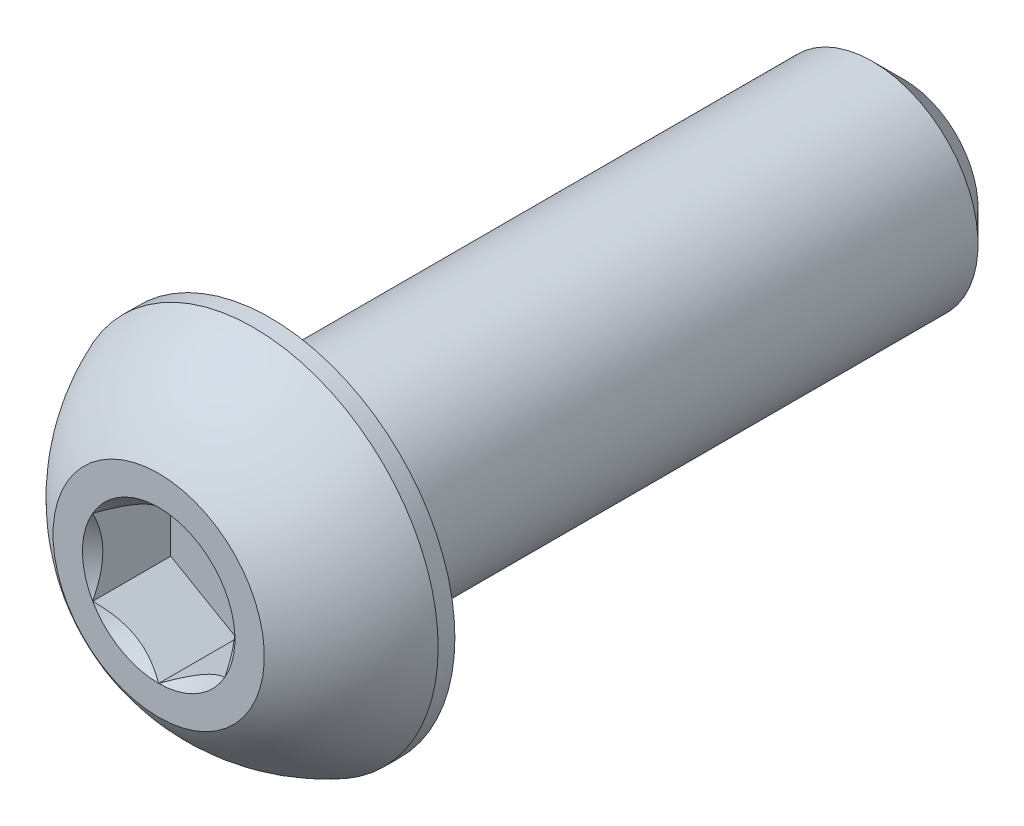
ISO-10303-21;
HEADER;
FILE_DESCRIPTION(('STEP AP214'),'2;1');
FILE_NAME('part.step','',(''),(''),'','','');
FILE_SCHEMA(('AUTOMOTIVE_DESIGN { 1 0 10303 214 1 1 1 1 }'));
ENDSEC;
DATA;
#1=APPLICATION_CONTEXT('core data for automotive mechanical design processes');
#2=APPLICATION_PROTOCOL_DEFINITION('international standard','automotive_design',2000,#1);
#3=PRODUCT_CONTEXT('',#1,'mechanical');
#4=PRODUCT('Part','Part','',(#3));
#5=PRODUCT_RELATED_PRODUCT_CATEGORY('part','',(#4));
#6=PRODUCT_DEFINITION_FORMATION('','',#4);
#7=PRODUCT_DEFINITION_CONTEXT('part definition',#1,'design');
#8=PRODUCT_DEFINITION('design','',#6,#7);
#9=PRODUCT_DEFINITION_SHAPE('','',#8);
#10=(LENGTH_UNIT() NAMED_UNIT(*) SI_UNIT(.MILLI.,.METRE.));
#11=(NAMED_UNIT(*) PLANE_ANGLE_UNIT() SI_UNIT($,.RADIAN.));
#12=(NAMED_UNIT(*) SI_UNIT($,.STERADIAN.) SOLID_ANGLE_UNIT());
#13=UNCERTAINTY_MEASURE_WITH_UNIT(LENGTH_MEASURE(1.E-05),#10,'distance_accuracy_value','');
#14=(GEOMETRIC_REPRESENTATION_CONTEXT(3) GLOBAL_UNCERTAINTY_ASSIGNED_CONTEXT((#13)) GLOBAL_UNIT_ASSIGNED_CONTEXT((#10,
#11,#12)) REPRESENTATION_CONTEXT('',''));
#15=CARTESIAN_POINT('',(0.,0.,0.));
#16=DIRECTION('',(0.,0.,1.));
#17=DIRECTION('',(1.,0.,0.));
#18=AXIS2_PLACEMENT_3D('',#15,#16,#17);
#19=CARTESIAN_POINT('',(0.,-3.175,-22.4028));
#20=DIRECTION('',(0.,0.,-1.));
#21=DIRECTION('',(0.,1.,0.));
#22=AXIS2_PLACEMENT_3D('',#19,#20,#21);
#23=PLANE('',#22);
#24=CARTESIAN_POINT('',(0.,0.,-22.4028));
#25=DIRECTION('',(0.,0.,-1.));
#26=DIRECTION('',(0.,1.,0.));
#27=AXIS2_PLACEMENT_3D('',#24,#25,#26);
#28=CIRCLE('',#27,2.22250000000001);
#29=CARTESIAN_POINT('',(0.,2.22250000000001,-22.4028));
#30=VERTEX_POINT('',#29);
#31=EDGE_CURVE('E181',#30,#30,#28,.T.);
#32=ORIENTED_EDGE('',*,*,#31,.T.);
#33=EDGE_LOOP('',(#32));
#34=FACE_BOUND('',#33,.T.);
#35=ADVANCED_FACE('F41',(#34),#23,.T.);
#36=CARTESIAN_POINT('',(0.,0.,-22.4028));
#37=DIRECTION('',(0.,0.,-1.));
#38=DIRECTION('',(0.,1.,0.));
#39=AXIS2_PLACEMENT_3D('',#36,#37,#38);
#40=CYLINDRICAL_SURFACE('',#39,3.175);
#41=CARTESIAN_POINT('',(0.,0.,-21.4503));
#42=DIRECTION('',(0.,0.,-1.));
#43=DIRECTION('',(0.,1.,0.));
#44=AXIS2_PLACEMENT_3D('',#41,#42,#43);
#45=CIRCLE('',#44,3.175);
#46=CARTESIAN_POINT('',(0.,3.175,-21.4503));
#47=VERTEX_POINT('',#46);
#48=EDGE_CURVE('E55',#47,#47,#45,.F.);
#49=ORIENTED_EDGE('',*,*,#48,.T.);
#50=EDGE_LOOP('',(#49));
#51=FACE_BOUND('',#50,.T.);
#52=CARTESIAN_POINT('',(0.,0.,-3.3528));
#53=DIRECTION('',(0.,0.,1.));
#54=DIRECTION('',(1.,0.,0.));
#55=AXIS2_PLACEMENT_3D('',#52,#53,#54);
#56=CIRCLE('',#55,3.175);
#57=CARTESIAN_POINT('',(3.175,0.,-3.3528));
#58=VERTEX_POINT('',#57);
#59=EDGE_CURVE('E178',#58,#58,#56,.F.);
#60=ORIENTED_EDGE('',*,*,#59,.T.);
#61=EDGE_LOOP('',(#60));
#62=FACE_BOUND('',#61,.T.);
#63=ADVANCED_FACE('F186',(#51,#62),#40,.T.);
#64=CARTESIAN_POINT('',(0.,0.,-22.4028));
#65=DIRECTION('',(0.,0.,1.));
#66=DIRECTION('',(0.,-1.,0.));
#67=AXIS2_PLACEMENT_3D('',#64,#65,#66);
#68=CONICAL_SURFACE('',#67,2.22250000000001,0.785398163397448);
#69=ORIENTED_EDGE('',*,*,#48,.F.);
#70=EDGE_LOOP('',(#69));
#71=FACE_BOUND('',#70,.T.);
#72=ORIENTED_EDGE('',*,*,#31,.F.);
#73=EDGE_LOOP('',(#72));
#74=FACE_BOUND('',#73,.T.);
#75=ADVANCED_FACE('F43',(#71,#74),#68,.T.);
#76=CARTESIAN_POINT('',(0.,0.,-5.060315));
#77=DIRECTION('',(0.,0.,1.));
#78=DIRECTION('',(0.,-1.,0.));
#79=AXIS2_PLACEMENT_3D('',#76,#77,#78);
#80=SPHERICAL_SURFACE('',#79,5.97389428256184);
#81=CARTESIAN_POINT('',(0.,0.,0.));
#82=DIRECTION('',(0.,0.,1.));
#83=DIRECTION('',(1.,0.,0.));
#84=AXIS2_PLACEMENT_3D('',#81,#82,#83);
#85=CIRCLE('',#84,3.175);
#86=CARTESIAN_POINT('',(0.,-3.175,0.));
#87=VERTEX_POINT('',#86);
#88=EDGE_CURVE('E175',#87,#87,#85,.T.);
#89=CARTESIAN_POINT('',(0.,0.,-2.84988));
#90=DIRECTION('',(0.,0.,1.));
#91=DIRECTION('',(1.,0.,0.));
#92=AXIS2_PLACEMENT_3D('',#89,#90,#91);
#93=CIRCLE('',#92,5.5499);
#94=CARTESIAN_POINT('',(0.,-5.5499,-2.84988));
#95=VERTEX_POINT('',#94);
#96=EDGE_CURVE('E169',#95,#95,#93,.T.);
#97=CARTESIAN_POINT('',(0.,-3.175,0.));
#98=CARTESIAN_POINT('',(0.,-3.20828343957184,-0.0208830076580502));
#99=CARTESIAN_POINT('',(0.,-3.24136078860705,-0.0420944789280503));
#100=CARTESIAN_POINT('',(0.,-3.30709055775141,-0.0851658910984718));
#101=CARTESIAN_POINT('',(0.,-3.33974297786056,-0.107025831998893));
#102=CARTESIAN_POINT('',(0.,-3.40461014130008,-0.151385725836676));
#103=CARTESIAN_POINT('',(0.,-3.43682488463043,-0.173885678774039));
#104=CARTESIAN_POINT('',(0.,-3.50080416139461,-0.219516822259479));
#105=CARTESIAN_POINT('',(0.,-3.53256869482844,-0.242648012807557));
#106=CARTESIAN_POINT('',(0.,-3.59563518208834,-0.289532629449102));
#107=CARTESIAN_POINT('',(0.,-3.62693713591442,-0.313286055542569));
#108=CARTESIAN_POINT('',(0.,-3.68906627753106,-0.36140589409133));
#109=CARTESIAN_POINT('',(0.,-3.71989346532163,-0.385772306546626));
#110=CARTESIAN_POINT('',(0.,-3.78106107243204,-0.435108631276877));
#111=CARTESIAN_POINT('',(0.,-3.8114014917519,-0.460078543551833));
#112=CARTESIAN_POINT('',(0.,-3.87158374923259,-0.510612146063938));
#113=CARTESIAN_POINT('',(0.,-3.90142558739343,-0.536175836301086));
#114=CARTESIAN_POINT('',(0.,-3.96059906392414,-0.587887041792083));
#115=CARTESIAN_POINT('',(0.,-3.989930702294,-0.614034557045931));
#116=CARTESIAN_POINT('',(0.,-4.04807235926832,-0.666903232293407));
#117=CARTESIAN_POINT('',(0.,-4.07688237787279,-0.693624392287034));
#118=CARTESIAN_POINT('',(0.,-4.13396957842491,-0.747629953401057));
#119=CARTESIAN_POINT('',(0.,-4.16224676037257,-0.774914354521453));
#120=CARTESIAN_POINT('',(0.,-4.21825727817542,-0.830035774981947));
#121=CARTESIAN_POINT('',(0.,-4.24599061403061,-0.857872794322045));
#122=CARTESIAN_POINT('',(0.,-4.30090264195357,-0.91408861315902));
#123=CARTESIAN_POINT('',(0.,-4.32808133402134,-0.942467412655899));
#124=CARTESIAN_POINT('',(0.,-4.38187349261953,-0.999755742806741));
#125=CARTESIAN_POINT('',(0.,-4.40848695914995,-1.0286652734607));
#126=CARTESIAN_POINT('',(0.,-4.46113830498838,-1.08700381029123));
#127=CARTESIAN_POINT('',(0.,-4.48717618429639,-1.11643281646778));
#128=CARTESIAN_POINT('',(0.,-4.53866621810402,-1.17579884645643));
#129=CARTESIAN_POINT('',(0.,-4.56411837260364,-1.20573587026853));
#130=CARTESIAN_POINT('',(0.,-4.61442704725457,-1.26610627984964));
#131=CARTESIAN_POINT('',(0.,-4.63928356740587,-1.29653966561866));
#132=CARTESIAN_POINT('',(0.,-4.68839129572448,-1.3578909501815));
#133=CARTESIAN_POINT('',(0.,-4.71264250389178,-1.38880884897531));
#134=CARTESIAN_POINT('',(0.,-4.76053016627881,-1.45111712201534));
#135=CARTESIAN_POINT('',(0.,-4.78416662049853,-1.48250749626155));
#136=CARTESIAN_POINT('',(0.,-4.8308155723751,-1.54574849868041));
#137=CARTESIAN_POINT('',(0.,-4.85382807003194,-1.57759912685306));
#138=CARTESIAN_POINT('',(0.,-4.89922014909859,-1.64174823640362));
#139=CARTESIAN_POINT('',(0.,-4.92159973050841,-1.67404671778154));
#140=CARTESIAN_POINT('',(0.,-4.96571726381658,-1.73907895865427));
#141=CARTESIAN_POINT('',(0.,-4.98745521571493,-1.77181271814908));
#142=CARTESIAN_POINT('',(0.,-5.03028102654719,-1.83770277069632));
#143=CARTESIAN_POINT('',(0.,-5.0513688854811,-1.87085906374874));
#144=CARTESIAN_POINT('',(0.,-5.09288630004063,-1.93758127434189));
#145=CARTESIAN_POINT('',(0.,-5.11331585566624,-1.97114719188261));
#146=CARTESIAN_POINT('',(0.,-5.15350870956168,-2.03867558290299));
#147=CARTESIAN_POINT('',(0.,-5.17327200783151,-2.07263805638265));
#148=CARTESIAN_POINT('',(0.,-5.21212465239608,-2.14094633632486));
#149=CARTESIAN_POINT('',(0.,-5.23121399869082,-2.17529214278741));
#150=CARTESIAN_POINT('',(0.,-5.26871130697935,-2.2443537165359));
#151=CARTESIAN_POINT('',(0.,-5.28711926897315,-2.27906948382184));
#152=CARTESIAN_POINT('',(0.,-5.32324664200827,-2.3488574628552));
#153=CARTESIAN_POINT('',(0.,-5.3409660530496,-2.38392967460262));
#154=CARTESIAN_POINT('',(0.,-5.37570942417474,-2.45441688802313));
#155=CARTESIAN_POINT('',(0.,-5.39273338425856,-2.48983188969622));
#156=CARTESIAN_POINT('',(0.,-5.42607922958184,-2.56099089271574));
#157=CARTESIAN_POINT('',(0.,-5.44240111482132,-2.59673489406217));
#158=CARTESIAN_POINT('',(0.,-5.47433643994316,-2.66853798649801));
#159=CARTESIAN_POINT('',(0.,-5.48994987982553,-2.70459707758742));
#160=CARTESIAN_POINT('',(0.,-5.52046229408188,-2.77701628549785));
#161=CARTESIAN_POINT('',(0.,-5.53536126845586,-2.81337640231887));
#162=CARTESIAN_POINT('',(0.,-5.5499,-2.84988));
#163=B_SPLINE_CURVE_WITH_KNOTS('',3,(#97,#98,#99,#100,#101,#102,#103,#104,#105,#106,#107,#108,
#109,#110,#111,#112,#113,#114,#115,#116,#117,#118,#119,#120,#121,#122,#123,#124,#125,#126,#127,
#128,#129,#130,#131,#132,#133,#134,#135,#136,#137,#138,#139,#140,#141,#142,#143,#144,#145,#146,
#147,#148,#149,#150,#151,#152,#153,#154,#155,#156,#157,#158,#159,#160,#161,#162),.UNSPECIFIED.,
.F.,.F.,(4,2,2,2,2,2,2,2,2,2,2,2,2,2,2,2,2,2,2,2,2,2,2,2,2,2,2,2,2,2,2,2,4),(0.,0.1178750807537,
0.235750161507399,0.353625242261099,0.471500323014798,0.589375403768498,0.707250484522198,
0.825125565275897,0.943000646029597,1.0608757267833,1.17875080753699,1.2966258882907,
1.41450096904439,1.53237604979809,1.65025113055179,1.76812621130549,1.88600129205919,
2.00387637281289,2.12175145356659,2.23962653432029,2.35750161507399,2.47537669582769,
2.59325177658139,2.71112685733509,2.82900193808879,2.94687701884249,3.06475209959619,
3.18262718034989,3.30050226110359,3.41837734185729,3.53625242261099,3.65412750336469,
3.77200258411839),.UNSPECIFIED.);
#164=EDGE_CURVE('BSEAM191',#87,#95,#163,.T.);
#165=ORIENTED_EDGE('',*,*,#88,.F.);
#166=ORIENTED_EDGE('',*,*,#96,.T.);
#167=ORIENTED_EDGE('',*,*,#164,.T.);
#168=ORIENTED_EDGE('',*,*,#164,.F.);
#169=EDGE_LOOP('',(#165,#167,#166,#168));
#170=FACE_BOUND('',#169,.T.);
#171=ADVANCED_FACE('F191',(#170),#80,.T.);
#172=CARTESIAN_POINT('',(0.,-3.175,0.));
#173=DIRECTION('',(0.,0.,-1.));
#174=DIRECTION('',(-1.,0.,0.));
#175=AXIS2_PLACEMENT_3D('',#172,#173,#174);
#176=PLANE('',#175);
#177=CARTESIAN_POINT('',(0.,0.,0.));
#178=DIRECTION('',(0.,0.,1.));
#179=DIRECTION('',(1.,0.,0.));
#180=AXIS2_PLACEMENT_3D('',#177,#178,#179);
#181=CIRCLE('',#180,2.29135888084633);
#182=CARTESIAN_POINT('',(-1.984375,1.14567944042316,0.));
#183=VERTEX_POINT('',#182);
#184=CARTESIAN_POINT('',(-1.984375,-1.14567944042316,0.));
#185=VERTEX_POINT('',#184);
#186=EDGE_CURVE('E68',#183,#185,#181,.T.);
#187=ORIENTED_EDGE('',*,*,#186,.F.);
#188=CARTESIAN_POINT('',(0.,2.29135888084633,0.));
#189=VERTEX_POINT('',#188);
#190=EDGE_CURVE('E140',#189,#183,#181,.T.);
#191=ORIENTED_EDGE('',*,*,#190,.F.);
#192=CARTESIAN_POINT('',(1.984375,1.14567944042316,0.));
#193=VERTEX_POINT('',#192);
#194=EDGE_CURVE('E137',#193,#189,#181,.T.);
#195=ORIENTED_EDGE('',*,*,#194,.F.);
#196=CARTESIAN_POINT('',(1.984375,-1.14567944042316,0.));
#197=VERTEX_POINT('',#196);
#198=EDGE_CURVE('E108',#197,#193,#181,.T.);
#199=ORIENTED_EDGE('',*,*,#198,.F.);
#200=CARTESIAN_POINT('',(0.,-2.29135888084633,0.));
#201=VERTEX_POINT('',#200);
#202=EDGE_CURVE('E100',#201,#197,#181,.T.);
#203=ORIENTED_EDGE('',*,*,#202,.F.);
#204=EDGE_CURVE('E61',#185,#201,#181,.T.);
#205=ORIENTED_EDGE('',*,*,#204,.F.);
#206=EDGE_LOOP('',(#187,#191,#195,#199,#203,#205));
#207=FACE_BOUND('',#206,.T.);
#208=ORIENTED_EDGE('',*,*,#88,.T.);
#209=EDGE_LOOP('',(#208));
#210=FACE_BOUND('',#209,.T.);
#211=ADVANCED_FACE('F134',(#207,#210),#176,.F.);
#212=CARTESIAN_POINT('',(0.,-5.5499,-3.3528));
#213=DIRECTION('',(0.,0.,1.));
#214=DIRECTION('',(1.,0.,0.));
#215=AXIS2_PLACEMENT_3D('',#212,#213,#214);
#216=PLANE('',#215);
#217=ORIENTED_EDGE('',*,*,#59,.F.);
#218=EDGE_LOOP('',(#217));
#219=FACE_BOUND('',#218,.T.);
#220=CARTESIAN_POINT('',(0.,0.,-3.3528));
#221=DIRECTION('',(0.,0.,1.));
#222=DIRECTION('',(1.,0.,0.));
#223=AXIS2_PLACEMENT_3D('',#220,#221,#222);
#224=CIRCLE('',#223,5.5499);
#225=CARTESIAN_POINT('',(5.5499,0.,-3.3528));
#226=VERTEX_POINT('',#225);
#227=EDGE_CURVE('E172',#226,#226,#224,.T.);
#228=ORIENTED_EDGE('',*,*,#227,.F.);
#229=EDGE_LOOP('',(#228));
#230=FACE_BOUND('',#229,.T.);
#231=ADVANCED_FACE('F205',(#219,#230),#216,.F.);
#232=CARTESIAN_POINT('',(0.,0.,0.));
#233=DIRECTION('',(0.,0.,1.));
#234=DIRECTION('',(1.,0.,0.));
#235=AXIS2_PLACEMENT_3D('',#232,#233,#234);
#236=CYLINDRICAL_SURFACE('',#235,5.5499);
#237=ORIENTED_EDGE('',*,*,#96,.F.);
#238=EDGE_LOOP('',(#237));
#239=FACE_BOUND('',#238,.T.);
#240=ORIENTED_EDGE('',*,*,#227,.T.);
#241=EDGE_LOOP('',(#240));
#242=FACE_BOUND('',#241,.T.);
#243=ADVANCED_FACE('F208',(#239,#242),#236,.T.);
#244=CARTESIAN_POINT('',(0.,0.,0.));
#245=DIRECTION('',(0.,0.,1.));
#246=DIRECTION('',(1.,0.,0.));
#247=AXIS2_PLACEMENT_3D('',#244,#245,#246);
#248=CONICAL_SURFACE('',#247,2.29135888084633,0.78539816339745);
#249=ORIENTED_EDGE('',*,*,#198,.T.);
#250=CARTESIAN_POINT('',(1.984375,-2.28495242157822,0.734984078816568));
#251=CARTESIAN_POINT('',(1.984375,-2.22931635455402,0.692986685550762));
#252=CARTESIAN_POINT('',(1.984375,-2.17336876548389,0.651396054076336));
#253=CARTESIAN_POINT('',(1.984375,-2.06072770258171,0.569208461471479));
#254=CARTESIAN_POINT('',(1.984375,-2.00403404503435,0.528611752405042));
#255=CARTESIAN_POINT('',(1.984375,-1.88936329173488,0.448303503174668));
#256=CARTESIAN_POINT('',(1.984375,-1.83137965519348,0.408601258813307));
#257=CARTESIAN_POINT('',(1.984375,-1.7144280213784,0.330685173401292));
#258=CARTESIAN_POINT('',(1.984375,-1.65546009407228,0.292471227194368));
#259=CARTESIAN_POINT('',(1.984375,-1.47005472306035,0.176252834013637));
#260=CARTESIAN_POINT('',(1.984375,-1.34163909427883,0.101347886872381));
#261=CARTESIAN_POINT('',(1.984375,-1.0784038470548,-0.0356697845602627));
#262=CARTESIAN_POINT('',(1.984375,-0.943607781407424,-0.0978256335176254));
#263=CARTESIAN_POINT('',(1.984375,-0.741275100444881,-0.173867421311381));
#264=CARTESIAN_POINT('',(1.984375,-0.676735408881095,-0.195691938673995));
#265=CARTESIAN_POINT('',(1.984375,-0.546098118112761,-0.234159536462205));
#266=CARTESIAN_POINT('',(1.984375,-0.480000411919955,-0.250802259934452));
#267=CARTESIAN_POINT('',(1.984375,-0.347746170028531,-0.277764619130277));
#268=CARTESIAN_POINT('',(1.984375,-0.281612071479122,-0.288192590264109));
#269=CARTESIAN_POINT('',(1.984375,-0.14863662005235,-0.302521852623404));
#270=CARTESIAN_POINT('',(1.984375,-0.0817953907393235,-0.306424265772614));
#271=CARTESIAN_POINT('',(1.984375,0.0495156750890644,-0.307412948667327));
#272=CARTESIAN_POINT('',(1.984375,0.113983775102991,-0.304740821124985));
#273=CARTESIAN_POINT('',(1.984375,0.242367515846177,-0.293260789502485));
#274=CARTESIAN_POINT('',(1.984375,0.30628310229592,-0.284452289360786));
#275=CARTESIAN_POINT('',(1.984375,0.434181040262184,-0.261030978667103));
#276=CARTESIAN_POINT('',(1.984375,0.498145026858309,-0.246319393767914));
#277=CARTESIAN_POINT('',(1.984375,0.624675616953007,-0.211873818587874));
#278=CARTESIAN_POINT('',(1.984375,0.687242336899689,-0.192140248550805));
#279=CARTESIAN_POINT('',(1.984375,0.884225483826088,-0.12258776276924));
#280=CARTESIAN_POINT('',(1.984375,1.01583674256468,-0.0648475887435034));
#281=CARTESIAN_POINT('',(1.984375,1.27288659242652,0.063530336588798));
#282=CARTESIAN_POINT('',(1.984375,1.3983008827048,0.134214424919413));
#283=CARTESIAN_POINT('',(1.984375,1.57956687990221,0.244516663813199));
#284=CARTESIAN_POINT('',(1.984375,1.63738271299424,0.280969829475364));
#285=CARTESIAN_POINT('',(1.984375,1.75202215386202,0.355415963291705));
#286=CARTESIAN_POINT('',(1.984375,1.80884568601362,0.393409048078054));
#287=CARTESIAN_POINT('',(1.984375,1.92116923084255,0.470338808893091));
#288=CARTESIAN_POINT('',(1.984375,1.97667624512253,0.509265313038791));
#289=CARTESIAN_POINT('',(1.984375,2.08693170717166,0.588147746121386));
#290=CARTESIAN_POINT('',(1.984375,2.14168035934793,0.62810338902403));
#291=CARTESIAN_POINT('',(1.984375,2.19611149046622,0.668480611285427));
#292=B_SPLINE_CURVE_WITH_KNOTS('',3,(#250,#251,#252,#253,#254,#255,#256,#257,#258,#259,#260,
#261,#262,#263,#264,#265,#266,#267,#268,#269,#270,#271,#272,#273,#274,#275,#276,#277,#278,#279,
#280,#281,#282,#283,#284,#285,#286,#287,#288,#289,#290,#291),.UNSPECIFIED.,.F.,.F.,(4,2,2,2,2,2,
2,2,2,2,2,2,2,2,2,2,2,2,2,2,4),(0.,0.209126070008322,0.418304637356569,0.629103979977992,
0.839888401371185,1.28549951116127,1.72957750768351,1.93379389749971,2.13802435186698,
2.33858179514334,2.53910475350639,2.73236963400794,2.92565329006887,3.12231577097487,
3.31896180041345,3.74886295245172,4.18033428125362,4.3853601718029,4.59040161996383,
4.79377749165108,4.99709743524131),.UNSPECIFIED.);
#293=EDGE_CURVE('E11',#197,#193,#292,.T.);
#294=ORIENTED_EDGE('',*,*,#293,.F.);
#295=EDGE_LOOP('',(#249,#294));
#296=FACE_BOUND('',#295,.T.);
#297=ADVANCED_FACE('F112',(#296),#248,.F.);
#298=ORIENTED_EDGE('',*,*,#194,.T.);
#299=CARTESIAN_POINT('',(1.984575,1.14556397036933,0.000115478781843379));
#300=CARTESIAN_POINT('',(1.9163590048332,1.18494849354192,-0.0392371477360855));
#301=CARTESIAN_POINT('',(1.84700231489303,1.22499159714897,-0.0762786895538155));
#302=CARTESIAN_POINT('',(1.70557619954781,1.30664400291398,-0.144101141576677));
#303=CARTESIAN_POINT('',(1.63349332126322,1.34826107209555,-0.174844310908246));
#304=CARTESIAN_POINT('',(1.488141602734,1.43217992591557,-0.227508111188786));
#305=CARTESIAN_POINT('',(1.41490978751306,1.47446033414663,-0.249561124120036));
#306=CARTESIAN_POINT('',(1.26683381740529,1.55995203534886,-0.283538507056124));
#307=CARTESIAN_POINT('',(1.19199418724658,1.60316071596705,-0.295488243908271));
#308=CARTESIAN_POINT('',(1.06301458545618,1.6776271237807,-0.306269900918094));
#309=CARTESIAN_POINT('',(1.00904128422756,1.7087886237741,-0.30786610094093));
#310=CARTESIAN_POINT('',(0.901182881480199,1.77106070163465,-0.305178161134708));
#311=CARTESIAN_POINT('',(0.847297817514476,1.80217125782056,-0.300891959659541));
#312=CARTESIAN_POINT('',(0.740036461751395,1.86409863044402,-0.286683126986481));
#313=CARTESIAN_POINT('',(0.686660807239859,1.89491507894443,-0.276754189547727));
#314=CARTESIAN_POINT('',(0.580832482591103,1.95601509066828,-0.251804915725461));
#315=CARTESIAN_POINT('',(0.528379742028898,1.9862986945516,-0.236784969610512));
#316=CARTESIAN_POINT('',(0.394017661036351,2.06387267818152,-0.19219214836433));
#317=CARTESIAN_POINT('',(0.312941642841675,2.11068193911104,-0.159257004061667));
#318=CARTESIAN_POINT('',(0.19372669327016,2.17951072233758,-0.103657558797803));
#319=CARTESIAN_POINT('',(0.154440075613998,2.20219286161692,-0.0841224079481375));
#320=CARTESIAN_POINT('',(0.0765946381319467,2.24713694590237,-0.0432712618805984));
#321=CARTESIAN_POINT('',(0.0380353888983008,2.26939913882716,-0.0219563604316496));
#322=CARTESIAN_POINT('',(-0.00020000000000058,2.29147435090017,0.000115478781842942));
#323=B_SPLINE_CURVE_WITH_KNOTS('',3,(#299,#300,#301,#302,#303,#304,#305,#306,#307,#308,#309,
#310,#311,#312,#313,#314,#315,#316,#317,#318,#319,#320,#321,#322),.UNSPECIFIED.,.F.,.F.,(4,2,2,
2,2,2,2,2,2,2,2,4),(0.,0.264339630306627,0.530219665093694,0.79187641637146,1.05287424418109,
1.239639843932,1.42647091743852,1.61351120244035,1.8005371524754,2.09764209964316,
2.24579179873714,2.39385111134157),.UNSPECIFIED.);
#324=EDGE_CURVE('E139',#193,#189,#323,.T.);
#325=ORIENTED_EDGE('',*,*,#324,.F.);
#326=EDGE_LOOP('',(#298,#325));
#327=FACE_BOUND('',#326,.T.);
#328=ADVANCED_FACE('F293',(#327),#248,.F.);
#329=ORIENTED_EDGE('',*,*,#190,.T.);
#330=CARTESIAN_POINT('',(0.000199999999999608,2.29147435090017,0.000115478781843248));
#331=CARTESIAN_POINT('',(-0.0680159951668025,2.25208982772757,-0.0392371477360854));
#332=CARTESIAN_POINT('',(-0.137372685106966,2.21204672412052,-0.0762786895538155));
#333=CARTESIAN_POINT('',(-0.278798800452188,2.13039431835551,-0.144101141576677));
#334=CARTESIAN_POINT('',(-0.350881678736783,2.08877724917394,-0.174844310908246));
#335=CARTESIAN_POINT('',(-0.496233397266004,2.00485839535392,-0.227508111188786));
#336=CARTESIAN_POINT('',(-0.569465212486939,1.96257798712287,-0.249561124120036));
#337=CARTESIAN_POINT('',(-0.717541182594707,1.87708628592063,-0.283538507056124));
#338=CARTESIAN_POINT('',(-0.792380812753425,1.83387760530244,-0.295488243908272));
#339=CARTESIAN_POINT('',(-0.921360414543816,1.75941119748879,-0.306269900918094));
#340=CARTESIAN_POINT('',(-0.975333715772443,1.72824969749539,-0.307866100940931));
#341=CARTESIAN_POINT('',(-1.0831921185198,1.66597761963484,-0.305178161134708));
#342=CARTESIAN_POINT('',(-1.13707718248552,1.63486706344893,-0.300891959659541));
#343=CARTESIAN_POINT('',(-1.2443385382486,1.57293969082547,-0.286683126986481));
#344=CARTESIAN_POINT('',(-1.29771419276014,1.54212324232506,-0.276754189547727));
#345=CARTESIAN_POINT('',(-1.4035425174089,1.48102323060122,-0.251804915725462));
#346=CARTESIAN_POINT('',(-1.4559952579711,1.45073962671789,-0.236784969610512));
#347=CARTESIAN_POINT('',(-1.59035733896365,1.37316564308797,-0.19219214836433));
#348=CARTESIAN_POINT('',(-1.67143335715832,1.32635638215845,-0.159257004061668));
#349=CARTESIAN_POINT('',(-1.79064830672984,1.25752759893191,-0.103657558797804));
#350=CARTESIAN_POINT('',(-1.829934924386,1.23484545965257,-0.0841224079481378));
#351=CARTESIAN_POINT('',(-1.90778036186805,1.18990137536712,-0.0432712618805986));
#352=CARTESIAN_POINT('',(-1.9463396111017,1.16763918244233,-0.0219563604316498));
#353=CARTESIAN_POINT('',(-1.984575,1.14556397036933,0.000115478781842511));
#354=B_SPLINE_CURVE_WITH_KNOTS('',3,(#330,#331,#332,#333,#334,#335,#336,#337,#338,#339,#340,
#341,#342,#343,#344,#345,#346,#347,#348,#349,#350,#351,#352,#353),.UNSPECIFIED.,.F.,.F.,(4,2,2,
2,2,2,2,2,2,2,2,4),(0.,0.264339630306627,0.530219665093694,0.791876416371461,1.05287424418109,
1.239639843932,1.42647091743852,1.61351120244035,1.8005371524754,2.09764209964316,
2.24579179873714,2.39385111134157),.UNSPECIFIED.);
#355=EDGE_CURVE('E144',#189,#183,#354,.T.);
#356=ORIENTED_EDGE('',*,*,#355,.F.);
#357=EDGE_LOOP('',(#329,#356));
#358=FACE_BOUND('',#357,.T.);
#359=ADVANCED_FACE('F147',(#358),#248,.F.);
#360=ORIENTED_EDGE('',*,*,#186,.T.);
#361=CARTESIAN_POINT('',(-1.984375,-2.28495242157823,0.734984078816569));
#362=CARTESIAN_POINT('',(-1.984375,-2.22931635455402,0.692986685550762));
#363=CARTESIAN_POINT('',(-1.984375,-2.17336876548389,0.651396054076336));
#364=CARTESIAN_POINT('',(-1.984375,-2.06072770258171,0.56920846147148));
#365=CARTESIAN_POINT('',(-1.984375,-2.00403404503435,0.528611752405043));
#366=CARTESIAN_POINT('',(-1.984375,-1.88936329173489,0.448303503174669));
#367=CARTESIAN_POINT('',(-1.984375,-1.83137965519348,0.408601258813308));
#368=CARTESIAN_POINT('',(-1.984375,-1.7144280213784,0.330685173401292));
#369=CARTESIAN_POINT('',(-1.984375,-1.65546009407228,0.292471227194368));
#370=CARTESIAN_POINT('',(-1.984375,-1.47005472306035,0.176252834013636));
#371=CARTESIAN_POINT('',(-1.984375,-1.34163909427883,0.101347886872382));
#372=CARTESIAN_POINT('',(-1.984375,-1.0784038470548,-0.0356697845602624));
#373=CARTESIAN_POINT('',(-1.984375,-0.943607781407425,-0.0978256335176256));
#374=CARTESIAN_POINT('',(-1.984375,-0.741275100444882,-0.173867421311381));
#375=CARTESIAN_POINT('',(-1.984375,-0.676735408881095,-0.195691938673995));
#376=CARTESIAN_POINT('',(-1.984375,-0.546098118112762,-0.234159536462205));
#377=CARTESIAN_POINT('',(-1.984375,-0.480000411919956,-0.250802259934452));
#378=CARTESIAN_POINT('',(-1.984375,-0.347746170028532,-0.277764619130277));
#379=CARTESIAN_POINT('',(-1.984375,-0.281612071479123,-0.288192590264108));
#380=CARTESIAN_POINT('',(-1.984375,-0.14863662005235,-0.302521852623404));
#381=CARTESIAN_POINT('',(-1.984375,-0.0817953907393237,-0.306424265772614));
#382=CARTESIAN_POINT('',(-1.984375,0.0495156750890643,-0.307412948667328));
#383=CARTESIAN_POINT('',(-1.984375,0.113983775102991,-0.304740821124985));
#384=CARTESIAN_POINT('',(-1.984375,0.242367515846177,-0.293260789502485));
#385=CARTESIAN_POINT('',(-1.984375,0.306283102295919,-0.284452289360786));
#386=CARTESIAN_POINT('',(-1.984375,0.434181040262184,-0.261030978667103));
#387=CARTESIAN_POINT('',(-1.984375,0.498145026858309,-0.246319393767914));
#388=CARTESIAN_POINT('',(-1.984375,0.624675616953007,-0.211873818587874));
#389=CARTESIAN_POINT('',(-1.984375,0.687242336899689,-0.192140248550805));
#390=CARTESIAN_POINT('',(-1.984375,0.884225483826087,-0.12258776276924));
#391=CARTESIAN_POINT('',(-1.984375,1.01583674256468,-0.0648475887435036));
#392=CARTESIAN_POINT('',(-1.984375,1.27288659242652,0.0635303365887976));
#393=CARTESIAN_POINT('',(-1.984375,1.3983008827048,0.134214424919412));
#394=CARTESIAN_POINT('',(-1.984375,1.57956687990221,0.244516663813198));
#395=CARTESIAN_POINT('',(-1.984375,1.63738271299424,0.280969829475363));
#396=CARTESIAN_POINT('',(-1.984375,1.75202215386202,0.355415963291704));
#397=CARTESIAN_POINT('',(-1.984375,1.80884568601362,0.393409048078054));
#398=CARTESIAN_POINT('',(-1.984375,1.92116923084255,0.47033880889309));
#399=CARTESIAN_POINT('',(-1.984375,1.97667624512253,0.509265313038791));
#400=CARTESIAN_POINT('',(-1.984375,2.08693170717166,0.588147746121386));
#401=CARTESIAN_POINT('',(-1.984375,2.14168035934793,0.628103389024029));
#402=CARTESIAN_POINT('',(-1.984375,2.19611149046622,0.668480611285426));
#403=B_SPLINE_CURVE_WITH_KNOTS('',3,(#361,#362,#363,#364,#365,#366,#367,#368,#369,#370,#371,
#372,#373,#374,#375,#376,#377,#378,#379,#380,#381,#382,#383,#384,#385,#386,#387,#388,#389,#390,
#391,#392,#393,#394,#395,#396,#397,#398,#399,#400,#401,#402),.UNSPECIFIED.,.F.,.F.,(4,2,2,2,2,2,
2,2,2,2,2,2,2,2,2,2,2,2,2,2,4),(0.,0.209126070008322,0.41830463735657,0.629103979977993,
0.839888401371186,1.28549951116127,1.72957750768351,1.93379389749972,2.13802435186698,
2.33858179514334,2.53910475350639,2.73236963400794,2.92565329006887,3.12231577097488,
3.31896180041345,3.74886295245172,4.18033428125362,4.3853601718029,4.59040161996383,
4.79377749165108,4.99709743524131),.UNSPECIFIED.);
#404=EDGE_CURVE('E151',#183,#185,#403,.F.);
#405=ORIENTED_EDGE('',*,*,#404,.F.);
#406=EDGE_LOOP('',(#360,#405));
#407=FACE_BOUND('',#406,.T.);
#408=ADVANCED_FACE('F287',(#407),#248,.F.);
#409=ORIENTED_EDGE('',*,*,#204,.T.);
#410=CARTESIAN_POINT('',(-1.984575,-1.14556397036933,0.000115478781843379));
#411=CARTESIAN_POINT('',(-1.9163590048332,-1.18494849354192,-0.0392371477360847));
#412=CARTESIAN_POINT('',(-1.84700231489303,-1.22499159714897,-0.0762786895538149));
#413=CARTESIAN_POINT('',(-1.70557619954781,-1.30664400291398,-0.144101141576677));
#414=CARTESIAN_POINT('',(-1.63349332126322,-1.34826107209555,-0.174844310908247));
#415=CARTESIAN_POINT('',(-1.488141602734,-1.43217992591557,-0.227508111188786));
#416=CARTESIAN_POINT('',(-1.41490978751306,-1.47446033414663,-0.249561124120036));
#417=CARTESIAN_POINT('',(-1.26683381740529,-1.55995203534886,-0.283538507056124));
#418=CARTESIAN_POINT('',(-1.19199418724658,-1.60316071596705,-0.295488243908271));
#419=CARTESIAN_POINT('',(-1.06301458545618,-1.6776271237807,-0.306269900918094));
#420=CARTESIAN_POINT('',(-1.00904128422756,-1.7087886237741,-0.30786610094093));
#421=CARTESIAN_POINT('',(-0.9011828814802,-1.77106070163465,-0.305178161134707));
#422=CARTESIAN_POINT('',(-0.847297817514477,-1.80217125782056,-0.30089195965954));
#423=CARTESIAN_POINT('',(-0.740036461751396,-1.86409863044402,-0.286683126986481));
#424=CARTESIAN_POINT('',(-0.68666080723986,-1.89491507894443,-0.276754189547727));
#425=CARTESIAN_POINT('',(-0.580832482591103,-1.95601509066828,-0.251804915725461));
#426=CARTESIAN_POINT('',(-0.528379742028898,-1.9862986945516,-0.236784969610511));
#427=CARTESIAN_POINT('',(-0.394017661036351,-2.06387267818152,-0.19219214836433));
#428=CARTESIAN_POINT('',(-0.312941642841675,-2.11068193911104,-0.159257004061667));
#429=CARTESIAN_POINT('',(-0.19372669327016,-2.17951072233758,-0.103657558797803));
#430=CARTESIAN_POINT('',(-0.154440075613998,-2.20219286161692,-0.0841224079481371));
#431=CARTESIAN_POINT('',(-0.0765946381319465,-2.24713694590237,-0.0432712618805977));
#432=CARTESIAN_POINT('',(-0.0380353888983009,-2.26939913882716,-0.0219563604316487));
#433=CARTESIAN_POINT('',(0.000200000000000425,-2.29147435090017,0.000115478781843735));
#434=B_SPLINE_CURVE_WITH_KNOTS('',3,(#410,#411,#412,#413,#414,#415,#416,#417,#418,#419,#420,
#421,#422,#423,#424,#425,#426,#427,#428,#429,#430,#431,#432,#433),.UNSPECIFIED.,.F.,.F.,(4,2,2,
2,2,2,2,2,2,2,2,4),(0.,0.264339630306627,0.530219665093694,0.79187641637146,1.05287424418109,
1.239639843932,1.42647091743852,1.61351120244035,1.8005371524754,2.09764209964316,
2.24579179873714,2.39385111134157),.UNSPECIFIED.);
#435=EDGE_CURVE('E124',#185,#201,#434,.T.);
#436=ORIENTED_EDGE('',*,*,#435,.F.);
#437=EDGE_LOOP('',(#409,#436));
#438=FACE_BOUND('',#437,.T.);
#439=ADVANCED_FACE('F235',(#438),#248,.F.);
#440=ORIENTED_EDGE('',*,*,#202,.T.);
#441=CARTESIAN_POINT('',(-0.000199999999999594,-2.29147435090017,0.000115478781843681));
#442=CARTESIAN_POINT('',(0.0680159951668032,-2.25208982772757,-0.0392371477360843));
#443=CARTESIAN_POINT('',(0.137372685106967,-2.21204672412052,-0.0762786895538144));
#444=CARTESIAN_POINT('',(0.278798800452188,-2.13039431835551,-0.144101141576676));
#445=CARTESIAN_POINT('',(0.350881678736783,-2.08877724917394,-0.174844310908246));
#446=CARTESIAN_POINT('',(0.496233397266004,-2.00485839535392,-0.227508111188787));
#447=CARTESIAN_POINT('',(0.569465212486939,-1.96257798712287,-0.249561124120036));
#448=CARTESIAN_POINT('',(0.717541182594707,-1.87708628592063,-0.283538507056124));
#449=CARTESIAN_POINT('',(0.792380812753425,-1.83387760530244,-0.295488243908272));
#450=CARTESIAN_POINT('',(0.921360414543816,-1.75941119748879,-0.306269900918094));
#451=CARTESIAN_POINT('',(0.975333715772443,-1.72824969749539,-0.30786610094093));
#452=CARTESIAN_POINT('',(1.0831921185198,-1.66597761963484,-0.305178161134708));
#453=CARTESIAN_POINT('',(1.13707718248552,-1.63486706344893,-0.300891959659541));
#454=CARTESIAN_POINT('',(1.2443385382486,-1.57293969082547,-0.286683126986481));
#455=CARTESIAN_POINT('',(1.29771419276014,-1.54212324232506,-0.276754189547727));
#456=CARTESIAN_POINT('',(1.4035425174089,-1.48102323060122,-0.251804915725462));
#457=CARTESIAN_POINT('',(1.4559952579711,-1.45073962671789,-0.236784969610512));
#458=CARTESIAN_POINT('',(1.59035733896365,-1.37316564308797,-0.19219214836433));
#459=CARTESIAN_POINT('',(1.67143335715832,-1.32635638215845,-0.159257004061668));
#460=CARTESIAN_POINT('',(1.79064830672984,-1.25752759893191,-0.103657558797804));
#461=CARTESIAN_POINT('',(1.829934924386,-1.23484545965257,-0.0841224079481379));
#462=CARTESIAN_POINT('',(1.90778036186805,-1.18990137536712,-0.0432712618805987));
#463=CARTESIAN_POINT('',(1.9463396111017,-1.16763918244233,-0.0219563604316498));
#464=CARTESIAN_POINT('',(1.984575,-1.14556397036933,0.000115478781842673));
#465=B_SPLINE_CURVE_WITH_KNOTS('',3,(#441,#442,#443,#444,#445,#446,#447,#448,#449,#450,#451,
#452,#453,#454,#455,#456,#457,#458,#459,#460,#461,#462,#463,#464),.UNSPECIFIED.,.F.,.F.,(4,2,2,
2,2,2,2,2,2,2,2,4),(0.,0.264339630306627,0.530219665093695,0.791876416371461,1.05287424418109,
1.239639843932,1.42647091743852,1.61351120244035,1.8005371524754,2.09764209964316,
2.24579179873714,2.39385111134157),.UNSPECIFIED.);
#466=EDGE_CURVE('E104',#201,#197,#465,.T.);
#467=ORIENTED_EDGE('',*,*,#466,.F.);
#468=EDGE_LOOP('',(#440,#467));
#469=FACE_BOUND('',#468,.T.);
#470=ADVANCED_FACE('F102',(#469),#248,.F.);
#471=CARTESIAN_POINT('',(1.984375,-1.14567944042316,-2.34696));
#472=DIRECTION('',(0.,0.,1.));
#473=DIRECTION('',(1.,0.,0.));
#474=AXIS2_PLACEMENT_3D('',#471,#472,#473);
#475=PLANE('',#474);
#476=DIRECTION('',(0.866025403784438,0.5,0.));
#477=VECTOR('',#476,1.);
#478=CARTESIAN_POINT('',(0.,-2.29135888084633,-2.34696));
#479=LINE('',#478,#477);
#480=CARTESIAN_POINT('',(0.,-2.29135888084633,-2.34696));
#481=VERTEX_POINT('',#480);
#482=CARTESIAN_POINT('',(1.984375,-1.14567944042316,-2.34696));
#483=VERTEX_POINT('',#482);
#484=EDGE_CURVE('E123',#481,#483,#479,.T.);
#485=ORIENTED_EDGE('',*,*,#484,.T.);
#486=DIRECTION('',(0.,1.,0.));
#487=VECTOR('',#486,1.);
#488=CARTESIAN_POINT('',(1.984375,-1.14567944042316,-2.34696));
#489=LINE('',#488,#487);
#490=CARTESIAN_POINT('',(1.984375,1.14567944042316,-2.34696));
#491=VERTEX_POINT('',#490);
#492=EDGE_CURVE('E128',#483,#491,#489,.T.);
#493=ORIENTED_EDGE('',*,*,#492,.T.);
#494=DIRECTION('',(-0.866025403784439,0.5,0.));
#495=VECTOR('',#494,1.);
#496=CARTESIAN_POINT('',(1.984375,1.14567944042316,-2.34696));
#497=LINE('',#496,#495);
#498=CARTESIAN_POINT('',(0.,2.29135888084633,-2.34696));
#499=VERTEX_POINT('',#498);
#500=EDGE_CURVE('E277',#491,#499,#497,.T.);
#501=ORIENTED_EDGE('',*,*,#500,.T.);
#502=DIRECTION('',(-0.866025403784438,-0.5,0.));
#503=VECTOR('',#502,1.);
#504=CARTESIAN_POINT('',(0.,2.29135888084633,-2.34696));
#505=LINE('',#504,#503);
#506=CARTESIAN_POINT('',(-1.984375,1.14567944042316,-2.34696));
#507=VERTEX_POINT('',#506);
#508=EDGE_CURVE('E160',#499,#507,#505,.T.);
#509=ORIENTED_EDGE('',*,*,#508,.T.);
#510=DIRECTION('',(0.,-1.,0.));
#511=VECTOR('',#510,1.);
#512=CARTESIAN_POINT('',(-1.984375,1.14567944042316,-2.34696));
#513=LINE('',#512,#511);
#514=CARTESIAN_POINT('',(-1.984375,-1.14567944042316,-2.34696));
#515=VERTEX_POINT('',#514);
#516=EDGE_CURVE('E281',#507,#515,#513,.T.);
#517=ORIENTED_EDGE('',*,*,#516,.T.);
#518=DIRECTION('',(0.866025403784439,-0.5,0.));
#519=VECTOR('',#518,1.);
#520=CARTESIAN_POINT('',(-1.984375,-1.14567944042316,-2.34696));
#521=LINE('',#520,#519);
#522=EDGE_CURVE('E131',#515,#481,#521,.T.);
#523=ORIENTED_EDGE('',*,*,#522,.T.);
#524=EDGE_LOOP('',(#485,#493,#501,#509,#517,#523));
#525=FACE_BOUND('',#524,.T.);
#526=ADVANCED_FACE('F234',(#525),#475,.T.);
#527=CARTESIAN_POINT('',(1.984375,-1.14567944042316,-2.34696));
#528=DIRECTION('',(1.,0.,0.));
#529=DIRECTION('',(0.,0.,-1.));
#530=AXIS2_PLACEMENT_3D('',#527,#528,#529);
#531=PLANE('',#530);
#532=DIRECTION('',(0.,0.,1.));
#533=VECTOR('',#532,1.);
#534=CARTESIAN_POINT('',(1.984375,-1.14567944042316,-2.34696));
#535=LINE('',#534,#533);
#536=EDGE_CURVE('E120',#483,#197,#535,.T.);
#537=ORIENTED_EDGE('',*,*,#536,.T.);
#538=ORIENTED_EDGE('',*,*,#293,.T.);
#539=DIRECTION('',(0.,0.,1.));
#540=VECTOR('',#539,1.);
#541=CARTESIAN_POINT('',(1.984375,1.14567944042316,-2.34696));
#542=LINE('',#541,#540);
#543=EDGE_CURVE('E130',#491,#193,#542,.T.);
#544=ORIENTED_EDGE('',*,*,#543,.F.);
#545=ORIENTED_EDGE('',*,*,#492,.F.);
#546=EDGE_LOOP('',(#537,#538,#544,#545));
#547=FACE_BOUND('',#546,.T.);
#548=ADVANCED_FACE('F126',(#547),#531,.F.);
#549=CARTESIAN_POINT('',(1.984375,1.14567944042316,-2.34696));
#550=DIRECTION('',(0.5,0.866025403784439,0.));
#551=DIRECTION('',(-0.866025403784439,0.5,0.));
#552=AXIS2_PLACEMENT_3D('',#549,#550,#551);
#553=PLANE('',#552);
#554=ORIENTED_EDGE('',*,*,#543,.T.);
#555=ORIENTED_EDGE('',*,*,#324,.T.);
#556=DIRECTION('',(0.,0.,1.));
#557=VECTOR('',#556,1.);
#558=CARTESIAN_POINT('',(0.,2.29135888084633,-2.34696));
#559=LINE('',#558,#557);
#560=EDGE_CURVE('E156',#499,#189,#559,.T.);
#561=ORIENTED_EDGE('',*,*,#560,.F.);
#562=ORIENTED_EDGE('',*,*,#500,.F.);
#563=EDGE_LOOP('',(#554,#555,#561,#562));
#564=FACE_BOUND('',#563,.T.);
#565=ADVANCED_FACE('F154',(#564),#553,.F.);
#566=CARTESIAN_POINT('',(0.,2.29135888084633,-2.34696));
#567=DIRECTION('',(-0.5,0.866025403784438,0.));
#568=DIRECTION('',(-0.866025403784438,-0.5,0.));
#569=AXIS2_PLACEMENT_3D('',#566,#567,#568);
#570=PLANE('',#569);
#571=ORIENTED_EDGE('',*,*,#560,.T.);
#572=ORIENTED_EDGE('',*,*,#355,.T.);
#573=DIRECTION('',(0.,0.,1.));
#574=VECTOR('',#573,1.);
#575=CARTESIAN_POINT('',(-1.984375,1.14567944042316,-2.34696));
#576=LINE('',#575,#574);
#577=EDGE_CURVE('E162',#507,#183,#576,.T.);
#578=ORIENTED_EDGE('',*,*,#577,.F.);
#579=ORIENTED_EDGE('',*,*,#508,.F.);
#580=EDGE_LOOP('',(#571,#572,#578,#579));
#581=FACE_BOUND('',#580,.T.);
#582=ADVANCED_FACE('F158',(#581),#570,.F.);
#583=CARTESIAN_POINT('',(-1.984375,1.14567944042316,-2.34696));
#584=DIRECTION('',(-1.,0.,0.));
#585=DIRECTION('',(0.,0.,1.));
#586=AXIS2_PLACEMENT_3D('',#583,#584,#585);
#587=PLANE('',#586);
#588=ORIENTED_EDGE('',*,*,#577,.T.);
#589=ORIENTED_EDGE('',*,*,#404,.T.);
#590=DIRECTION('',(0.,0.,1.));
#591=VECTOR('',#590,1.);
#592=CARTESIAN_POINT('',(-1.984375,-1.14567944042316,-2.34696));
#593=LINE('',#592,#591);
#594=EDGE_CURVE('E164',#515,#185,#593,.T.);
#595=ORIENTED_EDGE('',*,*,#594,.F.);
#596=ORIENTED_EDGE('',*,*,#516,.F.);
#597=EDGE_LOOP('',(#588,#589,#595,#596));
#598=FACE_BOUND('',#597,.T.);
#599=ADVANCED_FACE('F256',(#598),#587,.F.);
#600=CARTESIAN_POINT('',(-1.984375,-1.14567944042316,-2.34696));
#601=DIRECTION('',(-0.5,-0.866025403784439,0.));
#602=DIRECTION('',(0.866025403784439,-0.5,0.));
#603=AXIS2_PLACEMENT_3D('',#600,#601,#602);
#604=PLANE('',#603);
#605=ORIENTED_EDGE('',*,*,#594,.T.);
#606=ORIENTED_EDGE('',*,*,#435,.T.);
#607=DIRECTION('',(0.,0.,1.));
#608=VECTOR('',#607,1.);
#609=CARTESIAN_POINT('',(0.,-2.29135888084633,-2.34696));
#610=LINE('',#609,#608);
#611=EDGE_CURVE('E122',#481,#201,#610,.T.);
#612=ORIENTED_EDGE('',*,*,#611,.F.);
#613=ORIENTED_EDGE('',*,*,#522,.F.);
#614=EDGE_LOOP('',(#605,#606,#612,#613));
#615=FACE_BOUND('',#614,.T.);
#616=ADVANCED_FACE('F215',(#615),#604,.F.);
#617=CARTESIAN_POINT('',(0.,-2.29135888084633,-2.34696));
#618=DIRECTION('',(0.5,-0.866025403784438,0.));
#619=DIRECTION('',(0.866025403784438,0.5,0.));
#620=AXIS2_PLACEMENT_3D('',#617,#618,#619);
#621=PLANE('',#620);
#622=ORIENTED_EDGE('',*,*,#611,.T.);
#623=ORIENTED_EDGE('',*,*,#466,.T.);
#624=ORIENTED_EDGE('',*,*,#536,.F.);
#625=ORIENTED_EDGE('',*,*,#484,.F.);
#626=EDGE_LOOP('',(#622,#623,#624,#625));
#627=FACE_BOUND('',#626,.T.);
#628=ADVANCED_FACE('F118',(#627),#621,.F.);
#629=CLOSED_SHELL('',(#35,#63,#75,#171,#211,#231,#243,#297,#328,#359,#408,#439,#470,#526,#548,
#565,#582,#599,#616,#628));
#630=MANIFOLD_SOLID_BREP('B2',#629);
#631=ADVANCED_BREP_SHAPE_REPRESENTATION('',(#18,#630),#14);
#632=SHAPE_DEFINITION_REPRESENTATION(#9,#631);
ENDSEC;
END-ISO-10303-21;
